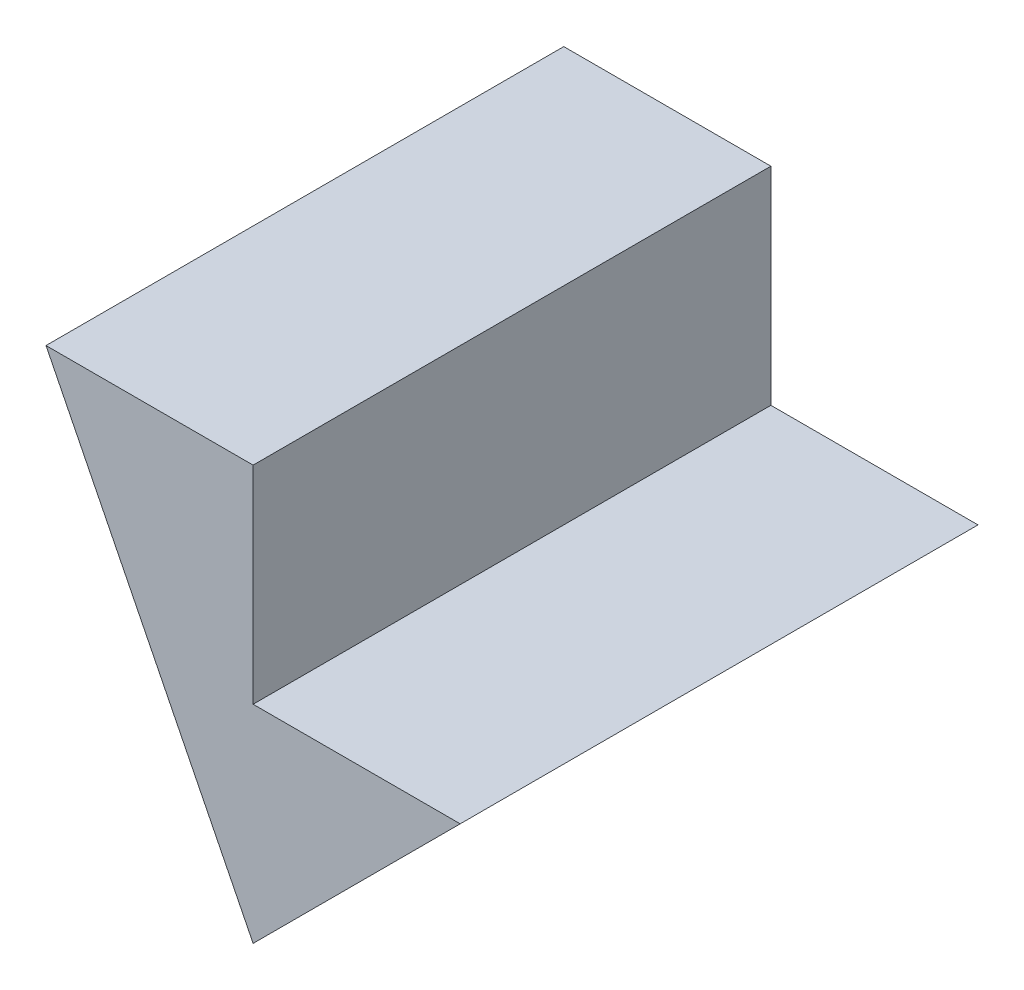
ISO-10303-21;
HEADER;
FILE_DESCRIPTION(('STEP AP214'),'2;1');
FILE_NAME('part.step','',(''),(''),'','','');
FILE_SCHEMA(('AUTOMOTIVE_DESIGN { 1 0 10303 214 1 1 1 1 }'));
ENDSEC;
DATA;
#1=APPLICATION_CONTEXT('core data for automotive mechanical design processes');
#2=APPLICATION_PROTOCOL_DEFINITION('international standard','automotive_design',2000,#1);
#3=PRODUCT_CONTEXT('',#1,'mechanical');
#4=PRODUCT('Part','Part','',(#3));
#5=PRODUCT_RELATED_PRODUCT_CATEGORY('part','',(#4));
#6=PRODUCT_DEFINITION_FORMATION('','',#4);
#7=PRODUCT_DEFINITION_CONTEXT('part definition',#1,'design');
#8=PRODUCT_DEFINITION('design','',#6,#7);
#9=PRODUCT_DEFINITION_SHAPE('','',#8);
#10=(LENGTH_UNIT() NAMED_UNIT(*) SI_UNIT(.MILLI.,.METRE.));
#11=(NAMED_UNIT(*) PLANE_ANGLE_UNIT() SI_UNIT($,.RADIAN.));
#12=(NAMED_UNIT(*) SI_UNIT($,.STERADIAN.) SOLID_ANGLE_UNIT());
#13=UNCERTAINTY_MEASURE_WITH_UNIT(LENGTH_MEASURE(1.E-05),#10,'distance_accuracy_value','');
#14=(GEOMETRIC_REPRESENTATION_CONTEXT(3) GLOBAL_UNCERTAINTY_ASSIGNED_CONTEXT((#13)) GLOBAL_UNIT_ASSIGNED_CONTEXT((#10,
#11,#12)) REPRESENTATION_CONTEXT('',''));
#15=CARTESIAN_POINT('',(0.,0.,0.));
#16=DIRECTION('',(0.,0.,1.));
#17=DIRECTION('',(1.,0.,0.));
#18=AXIS2_PLACEMENT_3D('',#15,#16,#17);
#19=CARTESIAN_POINT('',(0.,-20.,25.));
#20=DIRECTION('',(0.894427190999916,0.447213595499958,0.));
#21=DIRECTION('',(-0.447213595499958,0.894427190999916,0.));
#22=AXIS2_PLACEMENT_3D('',#19,#20,#21);
#23=PLANE('',#22);
#24=DIRECTION('',(0.447213595499958,-0.894427190999916,0.));
#25=VECTOR('',#24,1.);
#26=CARTESIAN_POINT('',(0.,-20.,0.));
#27=LINE('',#26,#25);
#28=CARTESIAN_POINT('',(-10.,0.,0.));
#29=VERTEX_POINT('',#28);
#30=CARTESIAN_POINT('',(0.,-20.,0.));
#31=VERTEX_POINT('',#30);
#32=EDGE_CURVE('E107',#29,#31,#27,.T.);
#33=ORIENTED_EDGE('',*,*,#32,.T.);
#34=DIRECTION('',(0.,0.,-1.));
#35=VECTOR('',#34,1.);
#36=CARTESIAN_POINT('',(0.,-20.,25.));
#37=LINE('',#36,#35);
#38=CARTESIAN_POINT('',(0.,-20.,25.));
#39=VERTEX_POINT('',#38);
#40=EDGE_CURVE('E11',#39,#31,#37,.T.);
#41=ORIENTED_EDGE('',*,*,#40,.F.);
#42=DIRECTION('',(0.447213595499958,-0.894427190999916,0.));
#43=VECTOR('',#42,1.);
#44=CARTESIAN_POINT('',(0.,-20.,25.));
#45=LINE('',#44,#43);
#46=CARTESIAN_POINT('',(-10.,0.,25.));
#47=VERTEX_POINT('',#46);
#48=EDGE_CURVE('E115',#47,#39,#45,.T.);
#49=ORIENTED_EDGE('',*,*,#48,.F.);
#50=DIRECTION('',(0.,0.,-1.));
#51=VECTOR('',#50,1.);
#52=CARTESIAN_POINT('',(-10.,0.,25.));
#53=LINE('',#52,#51);
#54=EDGE_CURVE('E103',#47,#29,#53,.T.);
#55=ORIENTED_EDGE('',*,*,#54,.T.);
#56=EDGE_LOOP('',(#33,#41,#49,#55));
#57=FACE_BOUND('',#56,.T.);
#58=ADVANCED_FACE('F33',(#57),#23,.F.);
#59=CARTESIAN_POINT('',(10.,-10.,25.));
#60=DIRECTION('',(-0.707106781186548,0.707106781186548,0.));
#61=DIRECTION('',(-0.707106781186548,-0.707106781186548,0.));
#62=AXIS2_PLACEMENT_3D('',#59,#60,#61);
#63=PLANE('',#62);
#64=DIRECTION('',(0.707106781186548,0.707106781186548,0.));
#65=VECTOR('',#64,1.);
#66=CARTESIAN_POINT('',(10.,-10.,0.));
#67=LINE('',#66,#65);
#68=CARTESIAN_POINT('',(10.,-10.,0.));
#69=VERTEX_POINT('',#68);
#70=EDGE_CURVE('E110',#31,#69,#67,.T.);
#71=ORIENTED_EDGE('',*,*,#70,.T.);
#72=DIRECTION('',(0.,0.,-1.));
#73=VECTOR('',#72,1.);
#74=CARTESIAN_POINT('',(10.,-10.,25.));
#75=LINE('',#74,#73);
#76=CARTESIAN_POINT('',(10.,-10.,25.));
#77=VERTEX_POINT('',#76);
#78=EDGE_CURVE('E41',#77,#69,#75,.T.);
#79=ORIENTED_EDGE('',*,*,#78,.F.);
#80=DIRECTION('',(0.707106781186548,0.707106781186548,0.));
#81=VECTOR('',#80,1.);
#82=CARTESIAN_POINT('',(10.,-10.,25.));
#83=LINE('',#82,#81);
#84=EDGE_CURVE('E83',#39,#77,#83,.T.);
#85=ORIENTED_EDGE('',*,*,#84,.F.);
#86=ORIENTED_EDGE('',*,*,#40,.T.);
#87=EDGE_LOOP('',(#71,#79,#85,#86));
#88=FACE_BOUND('',#87,.T.);
#89=ADVANCED_FACE('F134',(#88),#63,.F.);
#90=CARTESIAN_POINT('',(0.,-10.,25.));
#91=DIRECTION('',(0.,-1.,0.));
#92=DIRECTION('',(1.,0.,0.));
#93=AXIS2_PLACEMENT_3D('',#90,#91,#92);
#94=PLANE('',#93);
#95=DIRECTION('',(-1.,0.,0.));
#96=VECTOR('',#95,1.);
#97=CARTESIAN_POINT('',(0.,-10.,0.));
#98=LINE('',#97,#96);
#99=CARTESIAN_POINT('',(0.,-10.,0.));
#100=VERTEX_POINT('',#99);
#101=EDGE_CURVE('E98',#69,#100,#98,.T.);
#102=ORIENTED_EDGE('',*,*,#101,.T.);
#103=DIRECTION('',(0.,0.,-1.));
#104=VECTOR('',#103,1.);
#105=CARTESIAN_POINT('',(0.,-10.,25.));
#106=LINE('',#105,#104);
#107=CARTESIAN_POINT('',(0.,-10.,25.));
#108=VERTEX_POINT('',#107);
#109=EDGE_CURVE('E95',#108,#100,#106,.T.);
#110=ORIENTED_EDGE('',*,*,#109,.F.);
#111=DIRECTION('',(-1.,0.,0.));
#112=VECTOR('',#111,1.);
#113=CARTESIAN_POINT('',(0.,-10.,25.));
#114=LINE('',#113,#112);
#115=EDGE_CURVE('E87',#77,#108,#114,.T.);
#116=ORIENTED_EDGE('',*,*,#115,.F.);
#117=ORIENTED_EDGE('',*,*,#78,.T.);
#118=EDGE_LOOP('',(#102,#110,#116,#117));
#119=FACE_BOUND('',#118,.T.);
#120=ADVANCED_FACE('F96',(#119),#94,.F.);
#121=CARTESIAN_POINT('',(0.,0.,25.));
#122=DIRECTION('',(-1.,0.,0.));
#123=DIRECTION('',(0.,-1.,0.));
#124=AXIS2_PLACEMENT_3D('',#121,#122,#123);
#125=PLANE('',#124);
#126=DIRECTION('',(0.,1.,0.));
#127=VECTOR('',#126,1.);
#128=CARTESIAN_POINT('',(0.,0.,0.));
#129=LINE('',#128,#127);
#130=CARTESIAN_POINT('',(0.,0.,0.));
#131=VERTEX_POINT('',#130);
#132=EDGE_CURVE('E69',#100,#131,#129,.T.);
#133=ORIENTED_EDGE('',*,*,#132,.T.);
#134=DIRECTION('',(0.,0.,-1.));
#135=VECTOR('',#134,1.);
#136=CARTESIAN_POINT('',(0.,0.,25.));
#137=LINE('',#136,#135);
#138=CARTESIAN_POINT('',(0.,0.,25.));
#139=VERTEX_POINT('',#138);
#140=EDGE_CURVE('E99',#139,#131,#137,.T.);
#141=ORIENTED_EDGE('',*,*,#140,.F.);
#142=DIRECTION('',(0.,1.,0.));
#143=VECTOR('',#142,1.);
#144=CARTESIAN_POINT('',(0.,0.,25.));
#145=LINE('',#144,#143);
#146=EDGE_CURVE('E91',#108,#139,#145,.T.);
#147=ORIENTED_EDGE('',*,*,#146,.F.);
#148=ORIENTED_EDGE('',*,*,#109,.T.);
#149=EDGE_LOOP('',(#133,#141,#147,#148));
#150=FACE_BOUND('',#149,.T.);
#151=ADVANCED_FACE('F101',(#150),#125,.F.);
#152=CARTESIAN_POINT('',(-10.,0.,25.));
#153=DIRECTION('',(0.,-1.,0.));
#154=DIRECTION('',(0.,0.,-1.));
#155=AXIS2_PLACEMENT_3D('',#152,#153,#154);
#156=PLANE('',#155);
#157=DIRECTION('',(-1.,0.,0.));
#158=VECTOR('',#157,1.);
#159=CARTESIAN_POINT('',(-10.,0.,0.));
#160=LINE('',#159,#158);
#161=EDGE_CURVE('E75',#131,#29,#160,.T.);
#162=ORIENTED_EDGE('',*,*,#161,.T.);
#163=ORIENTED_EDGE('',*,*,#54,.F.);
#164=DIRECTION('',(-1.,0.,0.));
#165=VECTOR('',#164,1.);
#166=CARTESIAN_POINT('',(-10.,0.,25.));
#167=LINE('',#166,#165);
#168=EDGE_CURVE('E49',#139,#47,#167,.T.);
#169=ORIENTED_EDGE('',*,*,#168,.F.);
#170=ORIENTED_EDGE('',*,*,#140,.T.);
#171=EDGE_LOOP('',(#162,#163,#169,#170));
#172=FACE_BOUND('',#171,.T.);
#173=ADVANCED_FACE('F123',(#172),#156,.F.);
#174=CARTESIAN_POINT('',(0.,0.,25.));
#175=DIRECTION('',(0.,0.,1.));
#176=DIRECTION('',(1.,0.,0.));
#177=AXIS2_PLACEMENT_3D('',#174,#175,#176);
#178=PLANE('',#177);
#179=ORIENTED_EDGE('',*,*,#48,.T.);
#180=ORIENTED_EDGE('',*,*,#84,.T.);
#181=ORIENTED_EDGE('',*,*,#115,.T.);
#182=ORIENTED_EDGE('',*,*,#146,.T.);
#183=ORIENTED_EDGE('',*,*,#168,.T.);
#184=EDGE_LOOP('',(#179,#180,#181,#182,#183));
#185=FACE_BOUND('',#184,.T.);
#186=ADVANCED_FACE('F89',(#185),#178,.T.);
#187=CARTESIAN_POINT('',(0.,0.,0.));
#188=DIRECTION('',(0.,0.,1.));
#189=DIRECTION('',(1.,0.,0.));
#190=AXIS2_PLACEMENT_3D('',#187,#188,#189);
#191=PLANE('',#190);
#192=ORIENTED_EDGE('',*,*,#32,.F.);
#193=ORIENTED_EDGE('',*,*,#161,.F.);
#194=ORIENTED_EDGE('',*,*,#132,.F.);
#195=ORIENTED_EDGE('',*,*,#101,.F.);
#196=ORIENTED_EDGE('',*,*,#70,.F.);
#197=EDGE_LOOP('',(#192,#193,#194,#195,#196));
#198=FACE_BOUND('',#197,.T.);
#199=ADVANCED_FACE('F119',(#198),#191,.F.);
#200=CLOSED_SHELL('',(#58,#89,#120,#151,#173,#186,#199));
#201=MANIFOLD_SOLID_BREP('B2',#200);
#202=ADVANCED_BREP_SHAPE_REPRESENTATION('',(#18,#201),#14);
#203=SHAPE_DEFINITION_REPRESENTATION(#9,#202);
ENDSEC;
END-ISO-10303-21;
